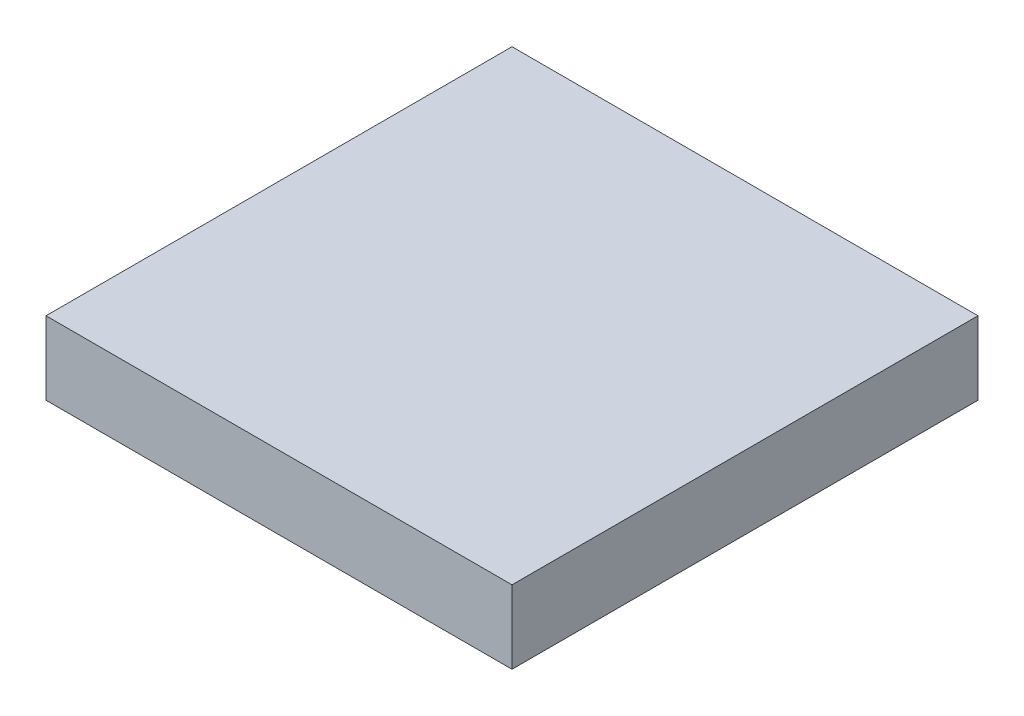
ISO-10303-21;
HEADER;
FILE_DESCRIPTION(('STEP AP214'),'2;1');
FILE_NAME('part.step','',(''),(''),'','','');
FILE_SCHEMA(('AUTOMOTIVE_DESIGN { 1 0 10303 214 1 1 1 1 }'));
ENDSEC;
DATA;
#1=APPLICATION_CONTEXT('core data for automotive mechanical design processes');
#2=APPLICATION_PROTOCOL_DEFINITION('international standard','automotive_design',2000,#1);
#3=PRODUCT_CONTEXT('',#1,'mechanical');
#4=PRODUCT('Part','Part','',(#3));
#5=PRODUCT_RELATED_PRODUCT_CATEGORY('part','',(#4));
#6=PRODUCT_DEFINITION_FORMATION('','',#4);
#7=PRODUCT_DEFINITION_CONTEXT('part definition',#1,'design');
#8=PRODUCT_DEFINITION('design','',#6,#7);
#9=PRODUCT_DEFINITION_SHAPE('','',#8);
#10=(LENGTH_UNIT() NAMED_UNIT(*) SI_UNIT(.MILLI.,.METRE.));
#11=(NAMED_UNIT(*) PLANE_ANGLE_UNIT() SI_UNIT($,.RADIAN.));
#12=(NAMED_UNIT(*) SI_UNIT($,.STERADIAN.) SOLID_ANGLE_UNIT());
#13=UNCERTAINTY_MEASURE_WITH_UNIT(LENGTH_MEASURE(1.E-05),#10,'distance_accuracy_value','');
#14=(GEOMETRIC_REPRESENTATION_CONTEXT(3) GLOBAL_UNCERTAINTY_ASSIGNED_CONTEXT((#13)) GLOBAL_UNIT_ASSIGNED_CONTEXT((#10,
#11,#12)) REPRESENTATION_CONTEXT('',''));
#15=CARTESIAN_POINT('',(0.,0.,0.));
#16=DIRECTION('',(0.,0.,1.));
#17=DIRECTION('',(1.,0.,0.));
#18=AXIS2_PLACEMENT_3D('',#15,#16,#17);
#19=CARTESIAN_POINT('',(0.,1.57,0.));
#20=DIRECTION('',(1.,0.,0.));
#21=DIRECTION('',(0.,0.,-1.));
#22=AXIS2_PLACEMENT_3D('',#19,#20,#21);
#23=PLANE('',#22);
#24=DIRECTION('',(0.,0.,1.));
#25=VECTOR('',#24,1.);
#26=CARTESIAN_POINT('',(0.,0.,0.));
#27=LINE('',#26,#25);
#28=CARTESIAN_POINT('',(0.,0.,-10.));
#29=VERTEX_POINT('',#28);
#30=CARTESIAN_POINT('',(0.,0.,0.));
#31=VERTEX_POINT('',#30);
#32=EDGE_CURVE('E113',#29,#31,#27,.T.);
#33=ORIENTED_EDGE('',*,*,#32,.T.);
#34=DIRECTION('',(0.,-1.,0.));
#35=VECTOR('',#34,1.);
#36=CARTESIAN_POINT('',(0.,1.57,0.));
#37=LINE('',#36,#35);
#38=CARTESIAN_POINT('',(0.,1.57,0.));
#39=VERTEX_POINT('',#38);
#40=EDGE_CURVE('E11',#39,#31,#37,.T.);
#41=ORIENTED_EDGE('',*,*,#40,.F.);
#42=DIRECTION('',(0.,0.,1.));
#43=VECTOR('',#42,1.);
#44=CARTESIAN_POINT('',(0.,1.57,0.));
#45=LINE('',#44,#43);
#46=CARTESIAN_POINT('',(0.,1.57,-10.));
#47=VERTEX_POINT('',#46);
#48=EDGE_CURVE('E97',#47,#39,#45,.T.);
#49=ORIENTED_EDGE('',*,*,#48,.F.);
#50=DIRECTION('',(0.,-1.,0.));
#51=VECTOR('',#50,1.);
#52=CARTESIAN_POINT('',(0.,1.57,-10.));
#53=LINE('',#52,#51);
#54=EDGE_CURVE('E109',#47,#29,#53,.T.);
#55=ORIENTED_EDGE('',*,*,#54,.T.);
#56=EDGE_LOOP('',(#33,#41,#49,#55));
#57=FACE_BOUND('',#56,.T.);
#58=ADVANCED_FACE('F45',(#57),#23,.F.);
#59=CARTESIAN_POINT('',(0.,1.57,0.));
#60=DIRECTION('',(0.,0.,-1.));
#61=DIRECTION('',(-1.,0.,0.));
#62=AXIS2_PLACEMENT_3D('',#59,#60,#61);
#63=PLANE('',#62);
#64=DIRECTION('',(1.,0.,0.));
#65=VECTOR('',#64,1.);
#66=CARTESIAN_POINT('',(0.,0.,0.));
#67=LINE('',#66,#65);
#68=CARTESIAN_POINT('',(10.,0.,0.));
#69=VERTEX_POINT('',#68);
#70=EDGE_CURVE('E102',#31,#69,#67,.T.);
#71=ORIENTED_EDGE('',*,*,#70,.T.);
#72=DIRECTION('',(0.,-1.,0.));
#73=VECTOR('',#72,1.);
#74=CARTESIAN_POINT('',(10.,1.57,0.));
#75=LINE('',#74,#73);
#76=CARTESIAN_POINT('',(10.,1.57,0.));
#77=VERTEX_POINT('',#76);
#78=EDGE_CURVE('E54',#77,#69,#75,.T.);
#79=ORIENTED_EDGE('',*,*,#78,.F.);
#80=DIRECTION('',(1.,0.,0.));
#81=VECTOR('',#80,1.);
#82=CARTESIAN_POINT('',(0.,1.57,0.));
#83=LINE('',#82,#81);
#84=EDGE_CURVE('E92',#39,#77,#83,.T.);
#85=ORIENTED_EDGE('',*,*,#84,.F.);
#86=ORIENTED_EDGE('',*,*,#40,.T.);
#87=EDGE_LOOP('',(#71,#79,#85,#86));
#88=FACE_BOUND('',#87,.T.);
#89=ADVANCED_FACE('F101',(#88),#63,.F.);
#90=CARTESIAN_POINT('',(10.,1.57,0.));
#91=DIRECTION('',(-1.,0.,0.));
#92=DIRECTION('',(0.,0.,1.));
#93=AXIS2_PLACEMENT_3D('',#90,#91,#92);
#94=PLANE('',#93);
#95=DIRECTION('',(0.,0.,-1.));
#96=VECTOR('',#95,1.);
#97=CARTESIAN_POINT('',(10.,0.,0.));
#98=LINE('',#97,#96);
#99=CARTESIAN_POINT('',(10.,0.,-10.));
#100=VERTEX_POINT('',#99);
#101=EDGE_CURVE('E79',#69,#100,#98,.T.);
#102=ORIENTED_EDGE('',*,*,#101,.T.);
#103=DIRECTION('',(0.,-1.,0.));
#104=VECTOR('',#103,1.);
#105=CARTESIAN_POINT('',(10.,1.57,-10.));
#106=LINE('',#105,#104);
#107=CARTESIAN_POINT('',(10.,1.57,-10.));
#108=VERTEX_POINT('',#107);
#109=EDGE_CURVE('E104',#108,#100,#106,.T.);
#110=ORIENTED_EDGE('',*,*,#109,.F.);
#111=DIRECTION('',(0.,0.,-1.));
#112=VECTOR('',#111,1.);
#113=CARTESIAN_POINT('',(10.,1.57,0.));
#114=LINE('',#113,#112);
#115=EDGE_CURVE('E95',#77,#108,#114,.T.);
#116=ORIENTED_EDGE('',*,*,#115,.F.);
#117=ORIENTED_EDGE('',*,*,#78,.T.);
#118=EDGE_LOOP('',(#102,#110,#116,#117));
#119=FACE_BOUND('',#118,.T.);
#120=ADVANCED_FACE('F105',(#119),#94,.F.);
#121=CARTESIAN_POINT('',(0.,1.57,-10.));
#122=DIRECTION('',(0.,0.,1.));
#123=DIRECTION('',(1.,0.,0.));
#124=AXIS2_PLACEMENT_3D('',#121,#122,#123);
#125=PLANE('',#124);
#126=DIRECTION('',(-1.,0.,0.));
#127=VECTOR('',#126,1.);
#128=CARTESIAN_POINT('',(0.,0.,-10.));
#129=LINE('',#128,#127);
#130=EDGE_CURVE('E85',#100,#29,#129,.T.);
#131=ORIENTED_EDGE('',*,*,#130,.T.);
#132=ORIENTED_EDGE('',*,*,#54,.F.);
#133=DIRECTION('',(-1.,0.,0.));
#134=VECTOR('',#133,1.);
#135=CARTESIAN_POINT('',(0.,1.57,-10.));
#136=LINE('',#135,#134);
#137=EDGE_CURVE('E62',#108,#47,#136,.T.);
#138=ORIENTED_EDGE('',*,*,#137,.F.);
#139=ORIENTED_EDGE('',*,*,#109,.T.);
#140=EDGE_LOOP('',(#131,#132,#138,#139));
#141=FACE_BOUND('',#140,.T.);
#142=ADVANCED_FACE('F126',(#141),#125,.F.);
#143=CARTESIAN_POINT('',(0.,1.57,0.));
#144=DIRECTION('',(0.,-1.,0.));
#145=DIRECTION('',(0.,0.,-1.));
#146=AXIS2_PLACEMENT_3D('',#143,#144,#145);
#147=PLANE('',#146);
#148=ORIENTED_EDGE('',*,*,#48,.T.);
#149=ORIENTED_EDGE('',*,*,#84,.T.);
#150=ORIENTED_EDGE('',*,*,#115,.T.);
#151=ORIENTED_EDGE('',*,*,#137,.T.);
#152=EDGE_LOOP('',(#148,#149,#150,#151));
#153=FACE_BOUND('',#152,.T.);
#154=ADVANCED_FACE('F93',(#153),#147,.F.);
#155=CARTESIAN_POINT('',(0.,0.,0.));
#156=DIRECTION('',(0.,-1.,0.));
#157=DIRECTION('',(0.,0.,-1.));
#158=AXIS2_PLACEMENT_3D('',#155,#156,#157);
#159=PLANE('',#158);
#160=ORIENTED_EDGE('',*,*,#32,.F.);
#161=ORIENTED_EDGE('',*,*,#130,.F.);
#162=ORIENTED_EDGE('',*,*,#101,.F.);
#163=ORIENTED_EDGE('',*,*,#70,.F.);
#164=EDGE_LOOP('',(#160,#161,#162,#163));
#165=FACE_BOUND('',#164,.T.);
#166=ADVANCED_FACE('F129',(#165),#159,.T.);
#167=CLOSED_SHELL('',(#58,#89,#120,#142,#154,#166));
#168=MANIFOLD_SOLID_BREP('B2',#167);
#169=ADVANCED_BREP_SHAPE_REPRESENTATION('',(#18,#168),#14);
#170=SHAPE_DEFINITION_REPRESENTATION(#9,#169);
ENDSEC;
END-ISO-10303-21;
